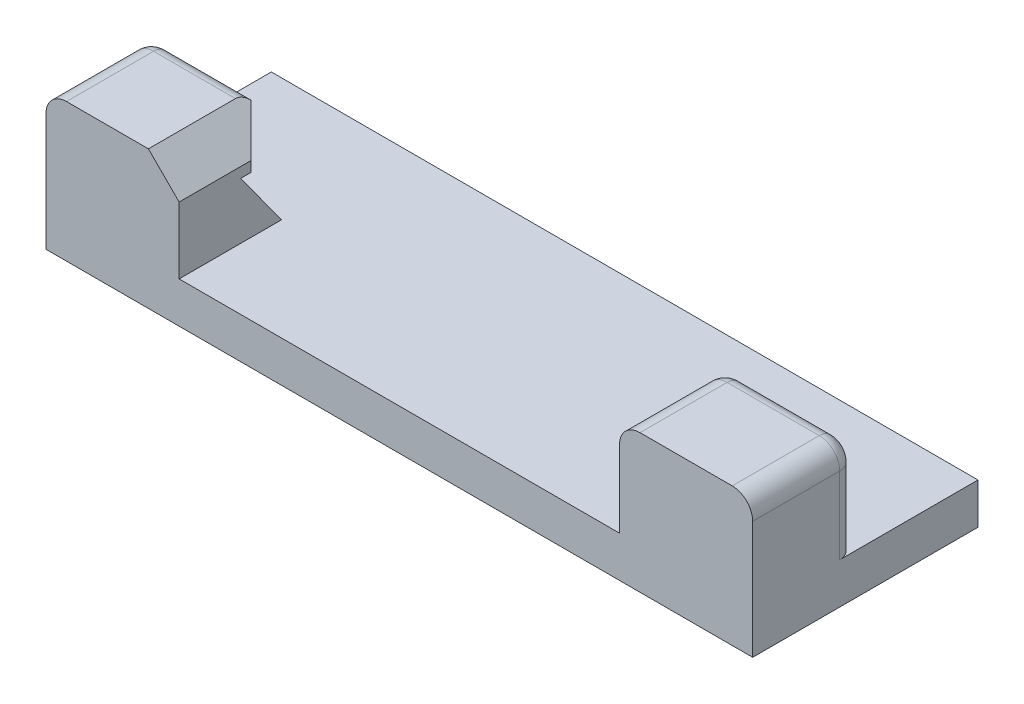
ISO-10303-21;
HEADER;
FILE_DESCRIPTION(('STEP AP214'),'2;1');
FILE_NAME('part.step','',(''),(''),'','','');
FILE_SCHEMA(('AUTOMOTIVE_DESIGN { 1 0 10303 214 1 1 1 1 }'));
ENDSEC;
DATA;
#1=APPLICATION_CONTEXT('core data for automotive mechanical design processes');
#2=APPLICATION_PROTOCOL_DEFINITION('international standard','automotive_design',2000,#1);
#3=PRODUCT_CONTEXT('',#1,'mechanical');
#4=PRODUCT('Part','Part','',(#3));
#5=PRODUCT_RELATED_PRODUCT_CATEGORY('part','',(#4));
#6=PRODUCT_DEFINITION_FORMATION('','',#4);
#7=PRODUCT_DEFINITION_CONTEXT('part definition',#1,'design');
#8=PRODUCT_DEFINITION('design','',#6,#7);
#9=PRODUCT_DEFINITION_SHAPE('','',#8);
#10=(LENGTH_UNIT() NAMED_UNIT(*) SI_UNIT(.MILLI.,.METRE.));
#11=(NAMED_UNIT(*) PLANE_ANGLE_UNIT() SI_UNIT($,.RADIAN.));
#12=(NAMED_UNIT(*) SI_UNIT($,.STERADIAN.) SOLID_ANGLE_UNIT());
#13=UNCERTAINTY_MEASURE_WITH_UNIT(LENGTH_MEASURE(1.E-05),#10,'distance_accuracy_value','');
#14=(GEOMETRIC_REPRESENTATION_CONTEXT(3) GLOBAL_UNCERTAINTY_ASSIGNED_CONTEXT((#13)) GLOBAL_UNIT_ASSIGNED_CONTEXT((#10,
#11,#12)) REPRESENTATION_CONTEXT('',''));
#15=CARTESIAN_POINT('',(0.,0.,0.));
#16=DIRECTION('',(0.,0.,1.));
#17=DIRECTION('',(1.,0.,0.));
#18=AXIS2_PLACEMENT_3D('',#15,#16,#17);
#19=CARTESIAN_POINT('',(-34.5,12.5,1.00000000000001));
#20=DIRECTION('',(0.,0.,1.));
#21=DIRECTION('',(1.,0.,0.));
#22=AXIS2_PLACEMENT_3D('',#19,#20,#21);
#23=PLANE('',#22);
#24=CARTESIAN_POINT('',(-32.5,10.5,1.00000000000001));
#25=DIRECTION('',(0.,0.,1.));
#26=DIRECTION('',(1.,0.,0.));
#27=AXIS2_PLACEMENT_3D('',#24,#25,#26);
#28=CIRCLE('',#27,0.5);
#29=CARTESIAN_POINT('',(-32.5,11.,1.00000000000001));
#30=VERTEX_POINT('',#29);
#31=CARTESIAN_POINT('',(-33.,10.5,1.00000000000001));
#32=VERTEX_POINT('',#31);
#33=EDGE_CURVE('E352',#30,#32,#28,.T.);
#34=ORIENTED_EDGE('',*,*,#33,.F.);
#35=DIRECTION('',(-1.,0.,0.));
#36=VECTOR('',#35,1.);
#37=CARTESIAN_POINT('',(-34.5,11.,1.00000000000001));
#38=LINE('',#37,#36);
#39=CARTESIAN_POINT('',(-24.5,11.,1.00000000000001));
#40=VERTEX_POINT('',#39);
#41=EDGE_CURVE('E339',#30,#40,#38,.F.);
#42=ORIENTED_EDGE('',*,*,#41,.T.);
#43=DIRECTION('',(0.,-1.,0.));
#44=VECTOR('',#43,1.);
#45=CARTESIAN_POINT('',(-24.5,12.5,1.00000000000001));
#46=LINE('',#45,#44);
#47=CARTESIAN_POINT('',(-24.5,8.5,0.999999999999996));
#48=VERTEX_POINT('',#47);
#49=EDGE_CURVE('E208',#40,#48,#46,.T.);
#50=ORIENTED_EDGE('',*,*,#49,.T.);
#51=DIRECTION('',(1.,0.,0.));
#52=VECTOR('',#51,1.);
#53=CARTESIAN_POINT('',(-31.5,8.5,0.999999999999996));
#54=LINE('',#53,#52);
#55=CARTESIAN_POINT('',(-31.5,8.5,0.999999999999996));
#56=VERTEX_POINT('',#55);
#57=EDGE_CURVE('E202',#56,#48,#54,.T.);
#58=ORIENTED_EDGE('',*,*,#57,.F.);
#59=DIRECTION('',(0.,1.,0.));
#60=VECTOR('',#59,1.);
#61=CARTESIAN_POINT('',(-31.5,3.,0.999999999999996));
#62=LINE('',#61,#60);
#63=CARTESIAN_POINT('',(-31.5,3.,1.00000000000001));
#64=VERTEX_POINT('',#63);
#65=EDGE_CURVE('E187',#64,#56,#62,.T.);
#66=ORIENTED_EDGE('',*,*,#65,.F.);
#67=DIRECTION('',(-1.,0.,0.));
#68=VECTOR('',#67,1.);
#69=CARTESIAN_POINT('',(-34.5,3.,1.00000000000001));
#70=LINE('',#69,#68);
#71=CARTESIAN_POINT('',(-33.,3.,1.00000000000001));
#72=VERTEX_POINT('',#71);
#73=EDGE_CURVE('E232',#64,#72,#70,.T.);
#74=ORIENTED_EDGE('',*,*,#73,.T.);
#75=DIRECTION('',(0.,-1.,0.));
#76=VECTOR('',#75,1.);
#77=CARTESIAN_POINT('',(-33.,12.5,1.00000000000001));
#78=LINE('',#77,#76);
#79=EDGE_CURVE('E341',#72,#32,#78,.F.);
#80=ORIENTED_EDGE('',*,*,#79,.T.);
#81=EDGE_LOOP('',(#34,#42,#50,#58,#66,#74,#80));
#82=FACE_BOUND('',#81,.T.);
#83=ADVANCED_FACE('F35',(#82),#23,.F.);
#84=CARTESIAN_POINT('',(0.,3.,0.));
#85=DIRECTION('',(0.,-1.,0.));
#86=DIRECTION('',(0.,0.,-1.));
#87=AXIS2_PLACEMENT_3D('',#84,#85,#86);
#88=PLANE('',#87);
#89=DIRECTION('',(-1.,0.,0.));
#90=VECTOR('',#89,1.);
#91=CARTESIAN_POINT('',(34.5,3.,0.999999999999996));
#92=LINE('',#91,#90);
#93=CARTESIAN_POINT('',(33.,3.,0.999999999999996));
#94=VERTEX_POINT('',#93);
#95=CARTESIAN_POINT('',(23.,3.,0.999999999999997));
#96=VERTEX_POINT('',#95);
#97=EDGE_CURVE('E211',#94,#96,#92,.T.);
#98=ORIENTED_EDGE('',*,*,#97,.F.);
#99=CARTESIAN_POINT('',(33.,3.,2.5));
#100=DIRECTION('',(0.,-1.,0.));
#101=DIRECTION('',(0.,0.,-1.));
#102=AXIS2_PLACEMENT_3D('',#99,#100,#101);
#103=CIRCLE('',#102,1.5);
#104=CARTESIAN_POINT('',(34.5,3.,2.5));
#105=VERTEX_POINT('',#104);
#106=EDGE_CURVE('E303',#94,#105,#103,.T.);
#107=ORIENTED_EDGE('',*,*,#106,.T.);
#108=DIRECTION('',(0.,0.,-1.));
#109=VECTOR('',#108,1.);
#110=CARTESIAN_POINT('',(34.5,3.,-11.));
#111=LINE('',#110,#109);
#112=CARTESIAN_POINT('',(34.5,3.,-11.));
#113=VERTEX_POINT('',#112);
#114=EDGE_CURVE('E241',#105,#113,#111,.T.);
#115=ORIENTED_EDGE('',*,*,#114,.T.);
#116=DIRECTION('',(-1.,0.,0.));
#117=VECTOR('',#116,1.);
#118=CARTESIAN_POINT('',(34.5,3.,-11.));
#119=LINE('',#118,#117);
#120=CARTESIAN_POINT('',(-34.5,3.,-11.));
#121=VERTEX_POINT('',#120);
#122=EDGE_CURVE('E243',#113,#121,#119,.T.);
#123=ORIENTED_EDGE('',*,*,#122,.T.);
#124=DIRECTION('',(0.,0.,1.));
#125=VECTOR('',#124,1.);
#126=CARTESIAN_POINT('',(-34.5,3.,-11.));
#127=LINE('',#126,#125);
#128=CARTESIAN_POINT('',(-34.5,3.,2.50000000000001));
#129=VERTEX_POINT('',#128);
#130=EDGE_CURVE('E235',#121,#129,#127,.T.);
#131=ORIENTED_EDGE('',*,*,#130,.T.);
#132=CARTESIAN_POINT('',(-33.,3.,2.50000000000001));
#133=DIRECTION('',(0.,-1.,0.));
#134=DIRECTION('',(0.,0.,-1.));
#135=AXIS2_PLACEMENT_3D('',#132,#133,#134);
#136=CIRCLE('',#135,1.5);
#137=EDGE_CURVE('E350',#129,#72,#136,.T.);
#138=ORIENTED_EDGE('',*,*,#137,.T.);
#139=ORIENTED_EDGE('',*,*,#73,.F.);
#140=CARTESIAN_POINT('',(-21.5,3.,0.999999999999996));
#141=VERTEX_POINT('',#140);
#142=EDGE_CURVE('E229',#141,#64,#70,.T.);
#143=ORIENTED_EDGE('',*,*,#142,.F.);
#144=DIRECTION('',(0.,0.,-1.));
#145=VECTOR('',#144,1.);
#146=CARTESIAN_POINT('',(-21.5,3.,11.));
#147=LINE('',#146,#145);
#148=CARTESIAN_POINT('',(-21.5,3.,11.));
#149=VERTEX_POINT('',#148);
#150=EDGE_CURVE('E225',#149,#141,#147,.T.);
#151=ORIENTED_EDGE('',*,*,#150,.F.);
#152=DIRECTION('',(1.,0.,0.));
#153=VECTOR('',#152,1.);
#154=CARTESIAN_POINT('',(34.5,3.,11.));
#155=LINE('',#154,#153);
#156=CARTESIAN_POINT('',(21.5,3.,11.));
#157=VERTEX_POINT('',#156);
#158=EDGE_CURVE('E238',#149,#157,#155,.T.);
#159=ORIENTED_EDGE('',*,*,#158,.T.);
#160=DIRECTION('',(0.,0.,1.));
#161=VECTOR('',#160,1.);
#162=CARTESIAN_POINT('',(21.5,3.,11.));
#163=LINE('',#162,#161);
#164=CARTESIAN_POINT('',(21.5,3.,2.5));
#165=VERTEX_POINT('',#164);
#166=EDGE_CURVE('E219',#165,#157,#163,.T.);
#167=ORIENTED_EDGE('',*,*,#166,.F.);
#168=CARTESIAN_POINT('',(23.,3.,2.5));
#169=DIRECTION('',(0.,-1.,0.));
#170=DIRECTION('',(0.,0.,-1.));
#171=AXIS2_PLACEMENT_3D('',#168,#169,#170);
#172=CIRCLE('',#171,1.5);
#173=EDGE_CURVE('E306',#165,#96,#172,.T.);
#174=ORIENTED_EDGE('',*,*,#173,.T.);
#175=EDGE_LOOP('',(#98,#107,#115,#123,#131,#138,#139,#143,#151,#159,#167,#174));
#176=FACE_BOUND('',#175,.T.);
#177=ADVANCED_FACE('F383',(#176),#88,.F.);
#178=CARTESIAN_POINT('',(-34.5,-1.,-11.));
#179=DIRECTION('',(-1.,0.,0.));
#180=DIRECTION('',(0.,0.,1.));
#181=AXIS2_PLACEMENT_3D('',#178,#179,#180);
#182=PLANE('',#181);
#183=DIRECTION('',(0.,1.,0.));
#184=VECTOR('',#183,1.);
#185=CARTESIAN_POINT('',(-34.5,-1.,11.));
#186=LINE('',#185,#184);
#187=CARTESIAN_POINT('',(-34.5,-1.,11.));
#188=VERTEX_POINT('',#187);
#189=CARTESIAN_POINT('',(-34.5,10.5,11.));
#190=VERTEX_POINT('',#189);
#191=EDGE_CURVE('E258',#188,#190,#186,.T.);
#192=ORIENTED_EDGE('',*,*,#191,.T.);
#193=DIRECTION('',(0.,0.,1.));
#194=VECTOR('',#193,1.);
#195=CARTESIAN_POINT('',(-34.5,10.5,2.50000000000001));
#196=LINE('',#195,#194);
#197=CARTESIAN_POINT('',(-34.5,10.5,2.50000000000001));
#198=VERTEX_POINT('',#197);
#199=EDGE_CURVE('E11',#190,#198,#196,.F.);
#200=ORIENTED_EDGE('',*,*,#199,.T.);
#201=DIRECTION('',(0.,-1.,0.));
#202=VECTOR('',#201,1.);
#203=CARTESIAN_POINT('',(-34.5,3.,2.50000000000001));
#204=LINE('',#203,#202);
#205=EDGE_CURVE('E336',#198,#129,#204,.T.);
#206=ORIENTED_EDGE('',*,*,#205,.T.);
#207=ORIENTED_EDGE('',*,*,#130,.F.);
#208=DIRECTION('',(0.,1.,0.));
#209=VECTOR('',#208,1.);
#210=CARTESIAN_POINT('',(-34.5,-1.,-11.));
#211=LINE('',#210,#209);
#212=CARTESIAN_POINT('',(-34.5,-1.,-11.));
#213=VERTEX_POINT('',#212);
#214=EDGE_CURVE('E259',#213,#121,#211,.T.);
#215=ORIENTED_EDGE('',*,*,#214,.F.);
#216=DIRECTION('',(0.,0.,1.));
#217=VECTOR('',#216,1.);
#218=CARTESIAN_POINT('',(-34.5,-1.,-11.));
#219=LINE('',#218,#217);
#220=EDGE_CURVE('E246',#213,#188,#219,.T.);
#221=ORIENTED_EDGE('',*,*,#220,.T.);
#222=EDGE_LOOP('',(#192,#200,#206,#207,#215,#221));
#223=FACE_BOUND('',#222,.T.);
#224=ADVANCED_FACE('F388',(#223),#182,.T.);
#225=CARTESIAN_POINT('',(34.5,-1.,-11.));
#226=DIRECTION('',(0.,0.,-1.));
#227=DIRECTION('',(-1.,0.,0.));
#228=AXIS2_PLACEMENT_3D('',#225,#226,#227);
#229=PLANE('',#228);
#230=ORIENTED_EDGE('',*,*,#214,.T.);
#231=ORIENTED_EDGE('',*,*,#122,.F.);
#232=DIRECTION('',(0.,1.,0.));
#233=VECTOR('',#232,1.);
#234=CARTESIAN_POINT('',(34.5,-1.,-11.));
#235=LINE('',#234,#233);
#236=CARTESIAN_POINT('',(34.5,-1.,-11.));
#237=VERTEX_POINT('',#236);
#238=EDGE_CURVE('E262',#237,#113,#235,.T.);
#239=ORIENTED_EDGE('',*,*,#238,.F.);
#240=DIRECTION('',(-1.,0.,0.));
#241=VECTOR('',#240,1.);
#242=CARTESIAN_POINT('',(34.5,-1.,-11.));
#243=LINE('',#242,#241);
#244=EDGE_CURVE('E255',#237,#213,#243,.T.);
#245=ORIENTED_EDGE('',*,*,#244,.T.);
#246=EDGE_LOOP('',(#230,#231,#239,#245));
#247=FACE_BOUND('',#246,.T.);
#248=ADVANCED_FACE('F479',(#247),#229,.T.);
#249=CARTESIAN_POINT('',(34.5,-1.,-11.));
#250=DIRECTION('',(1.,0.,0.));
#251=DIRECTION('',(0.,0.,-1.));
#252=AXIS2_PLACEMENT_3D('',#249,#250,#251);
#253=PLANE('',#252);
#254=ORIENTED_EDGE('',*,*,#114,.F.);
#255=DIRECTION('',(0.,-1.,0.));
#256=VECTOR('',#255,1.);
#257=CARTESIAN_POINT('',(34.5,10.5,2.5));
#258=LINE('',#257,#256);
#259=CARTESIAN_POINT('',(34.5,10.5,2.5));
#260=VERTEX_POINT('',#259);
#261=EDGE_CURVE('E293',#105,#260,#258,.F.);
#262=ORIENTED_EDGE('',*,*,#261,.T.);
#263=DIRECTION('',(0.,0.,-1.));
#264=VECTOR('',#263,1.);
#265=CARTESIAN_POINT('',(34.5,10.5,-11.));
#266=LINE('',#265,#264);
#267=CARTESIAN_POINT('',(34.5,10.5,11.));
#268=VERTEX_POINT('',#267);
#269=EDGE_CURVE('E280',#260,#268,#266,.F.);
#270=ORIENTED_EDGE('',*,*,#269,.T.);
#271=DIRECTION('',(0.,1.,0.));
#272=VECTOR('',#271,1.);
#273=CARTESIAN_POINT('',(34.5,-1.,11.));
#274=LINE('',#273,#272);
#275=CARTESIAN_POINT('',(34.5,-1.,11.));
#276=VERTEX_POINT('',#275);
#277=EDGE_CURVE('E265',#276,#268,#274,.T.);
#278=ORIENTED_EDGE('',*,*,#277,.F.);
#279=DIRECTION('',(0.,0.,-1.));
#280=VECTOR('',#279,1.);
#281=CARTESIAN_POINT('',(34.5,-1.,-11.));
#282=LINE('',#281,#280);
#283=EDGE_CURVE('E252',#276,#237,#282,.T.);
#284=ORIENTED_EDGE('',*,*,#283,.T.);
#285=ORIENTED_EDGE('',*,*,#238,.T.);
#286=EDGE_LOOP('',(#254,#262,#270,#278,#284,#285));
#287=FACE_BOUND('',#286,.T.);
#288=ADVANCED_FACE('F397',(#287),#253,.T.);
#289=CARTESIAN_POINT('',(34.5,-1.,11.));
#290=DIRECTION('',(0.,0.,1.));
#291=DIRECTION('',(1.,0.,0.));
#292=AXIS2_PLACEMENT_3D('',#289,#290,#291);
#293=PLANE('',#292);
#294=DIRECTION('',(1.,0.,0.));
#295=VECTOR('',#294,1.);
#296=CARTESIAN_POINT('',(-34.5,12.5,11.));
#297=LINE('',#296,#295);
#298=CARTESIAN_POINT('',(-32.5,12.5,11.));
#299=VERTEX_POINT('',#298);
#300=CARTESIAN_POINT('',(-24.5,12.5,11.));
#301=VERTEX_POINT('',#300);
#302=EDGE_CURVE('E226',#299,#301,#297,.T.);
#303=ORIENTED_EDGE('',*,*,#302,.F.);
#304=CARTESIAN_POINT('',(-32.5,10.5,11.));
#305=DIRECTION('',(0.,0.,1.));
#306=DIRECTION('',(1.,0.,0.));
#307=AXIS2_PLACEMENT_3D('',#304,#305,#306);
#308=CIRCLE('',#307,2.);
#309=EDGE_CURVE('E44',#299,#190,#308,.T.);
#310=ORIENTED_EDGE('',*,*,#309,.T.);
#311=ORIENTED_EDGE('',*,*,#191,.F.);
#312=DIRECTION('',(1.,0.,0.));
#313=VECTOR('',#312,1.);
#314=CARTESIAN_POINT('',(34.5,-1.,11.));
#315=LINE('',#314,#313);
#316=EDGE_CURVE('E249',#188,#276,#315,.T.);
#317=ORIENTED_EDGE('',*,*,#316,.T.);
#318=ORIENTED_EDGE('',*,*,#277,.T.);
#319=CARTESIAN_POINT('',(32.5,10.5,11.));
#320=DIRECTION('',(0.,0.,1.));
#321=DIRECTION('',(1.,0.,0.));
#322=AXIS2_PLACEMENT_3D('',#319,#320,#321);
#323=CIRCLE('',#322,2.);
#324=CARTESIAN_POINT('',(32.5,12.5,11.));
#325=VERTEX_POINT('',#324);
#326=EDGE_CURVE('E273',#268,#325,#323,.T.);
#327=ORIENTED_EDGE('',*,*,#326,.T.);
#328=DIRECTION('',(1.,0.,0.));
#329=VECTOR('',#328,1.);
#330=CARTESIAN_POINT('',(34.5,12.5,11.));
#331=LINE('',#330,#329);
#332=CARTESIAN_POINT('',(23.5,12.5,11.));
#333=VERTEX_POINT('',#332);
#334=EDGE_CURVE('E215',#333,#325,#331,.T.);
#335=ORIENTED_EDGE('',*,*,#334,.F.);
#336=CARTESIAN_POINT('',(23.5,10.5,11.));
#337=DIRECTION('',(0.,0.,1.));
#338=DIRECTION('',(1.,0.,0.));
#339=AXIS2_PLACEMENT_3D('',#336,#337,#338);
#340=CIRCLE('',#339,2.);
#341=CARTESIAN_POINT('',(21.5,10.5,11.));
#342=VERTEX_POINT('',#341);
#343=EDGE_CURVE('E275',#333,#342,#340,.T.);
#344=ORIENTED_EDGE('',*,*,#343,.T.);
#345=DIRECTION('',(0.,-1.,0.));
#346=VECTOR('',#345,1.);
#347=CARTESIAN_POINT('',(21.5,12.5,11.));
#348=LINE('',#347,#346);
#349=EDGE_CURVE('E218',#342,#157,#348,.T.);
#350=ORIENTED_EDGE('',*,*,#349,.T.);
#351=ORIENTED_EDGE('',*,*,#158,.F.);
#352=DIRECTION('',(0.,-1.,0.));
#353=VECTOR('',#352,1.);
#354=CARTESIAN_POINT('',(-21.5,12.5,11.));
#355=LINE('',#354,#353);
#356=CARTESIAN_POINT('',(-21.5,9.49999999999998,11.));
#357=VERTEX_POINT('',#356);
#358=EDGE_CURVE('E228',#357,#149,#355,.T.);
#359=ORIENTED_EDGE('',*,*,#358,.F.);
#360=DIRECTION('',(0.707106781186547,-0.707106781186548,0.));
#361=VECTOR('',#360,1.);
#362=CARTESIAN_POINT('',(11.7499999999999,-23.75,11.));
#363=LINE('',#362,#361);
#364=EDGE_CURVE('E333',#357,#301,#363,.F.);
#365=ORIENTED_EDGE('',*,*,#364,.T.);
#366=EDGE_LOOP('',(#303,#310,#311,#317,#318,#327,#335,#344,#350,#351,#359,#365));
#367=FACE_BOUND('',#366,.T.);
#368=ADVANCED_FACE('F391',(#367),#293,.T.);
#369=CARTESIAN_POINT('',(0.,-1.,0.));
#370=DIRECTION('',(0.,-1.,0.));
#371=DIRECTION('',(0.,0.,-1.));
#372=AXIS2_PLACEMENT_3D('',#369,#370,#371);
#373=PLANE('',#372);
#374=ORIENTED_EDGE('',*,*,#220,.F.);
#375=ORIENTED_EDGE('',*,*,#244,.F.);
#376=ORIENTED_EDGE('',*,*,#283,.F.);
#377=ORIENTED_EDGE('',*,*,#316,.F.);
#378=EDGE_LOOP('',(#374,#375,#376,#377));
#379=FACE_BOUND('',#378,.T.);
#380=ADVANCED_FACE('F394',(#379),#373,.T.);
#381=CARTESIAN_POINT('',(-21.5,12.5,11.));
#382=DIRECTION('',(-1.,0.,0.));
#383=DIRECTION('',(0.,0.,1.));
#384=AXIS2_PLACEMENT_3D('',#381,#382,#383);
#385=PLANE('',#384);
#386=DIRECTION('',(0.,0.,1.));
#387=VECTOR('',#386,1.);
#388=CARTESIAN_POINT('',(-21.5,8.5,0.999999999999996));
#389=LINE('',#388,#387);
#390=CARTESIAN_POINT('',(-21.5,8.5,4.00000000000002));
#391=VERTEX_POINT('',#390);
#392=CARTESIAN_POINT('',(-21.5,8.5,5.));
#393=VERTEX_POINT('',#392);
#394=EDGE_CURVE('E451',#391,#393,#389,.T.);
#395=ORIENTED_EDGE('',*,*,#394,.F.);
#396=DIRECTION('',(0.,1.,0.));
#397=VECTOR('',#396,1.);
#398=CARTESIAN_POINT('',(-21.5,12.5,4.00000000000002));
#399=LINE('',#398,#397);
#400=CARTESIAN_POINT('',(-21.5,9.49999999999998,4.00000000000002));
#401=VERTEX_POINT('',#400);
#402=EDGE_CURVE('E327',#391,#401,#399,.T.);
#403=ORIENTED_EDGE('',*,*,#402,.T.);
#404=DIRECTION('',(0.,0.,1.));
#405=VECTOR('',#404,1.);
#406=CARTESIAN_POINT('',(-21.5,9.49999999999998,11.));
#407=LINE('',#406,#405);
#408=EDGE_CURVE('E325',#401,#357,#407,.T.);
#409=ORIENTED_EDGE('',*,*,#408,.T.);
#410=ORIENTED_EDGE('',*,*,#358,.T.);
#411=ORIENTED_EDGE('',*,*,#150,.T.);
#412=DIRECTION('',(0.,-0.808736084303189,-0.588171697675046));
#413=VECTOR('',#412,1.);
#414=CARTESIAN_POINT('',(-21.5,3.,0.999999999999996));
#415=LINE('',#414,#413);
#416=EDGE_CURVE('E321',#393,#141,#415,.T.);
#417=ORIENTED_EDGE('',*,*,#416,.F.);
#418=EDGE_LOOP('',(#395,#403,#409,#410,#411,#417));
#419=FACE_BOUND('',#418,.T.);
#420=ADVANCED_FACE('F453',(#419),#385,.F.);
#421=CARTESIAN_POINT('',(0.,12.5,0.));
#422=DIRECTION('',(0.,-1.,0.));
#423=DIRECTION('',(0.,0.,-1.));
#424=AXIS2_PLACEMENT_3D('',#421,#422,#423);
#425=PLANE('',#424);
#426=DIRECTION('',(-1.,0.,0.));
#427=VECTOR('',#426,1.);
#428=CARTESIAN_POINT('',(0.,12.5,2.50000000000001));
#429=LINE('',#428,#427);
#430=CARTESIAN_POINT('',(-24.5,12.5,2.50000000000001));
#431=VERTEX_POINT('',#430);
#432=CARTESIAN_POINT('',(-32.5,12.5,2.50000000000001));
#433=VERTEX_POINT('',#432);
#434=EDGE_CURVE('E344',#431,#433,#429,.T.);
#435=ORIENTED_EDGE('',*,*,#434,.T.);
#436=DIRECTION('',(0.,0.,1.));
#437=VECTOR('',#436,1.);
#438=CARTESIAN_POINT('',(-32.5,12.5,11.));
#439=LINE('',#438,#437);
#440=EDGE_CURVE('E58',#433,#299,#439,.T.);
#441=ORIENTED_EDGE('',*,*,#440,.T.);
#442=ORIENTED_EDGE('',*,*,#302,.T.);
#443=DIRECTION('',(0.,0.,-1.));
#444=VECTOR('',#443,1.);
#445=CARTESIAN_POINT('',(-24.5,12.5,0.));
#446=LINE('',#445,#444);
#447=EDGE_CURVE('E330',#301,#431,#446,.T.);
#448=ORIENTED_EDGE('',*,*,#447,.T.);
#449=EDGE_LOOP('',(#435,#441,#442,#448));
#450=FACE_BOUND('',#449,.T.);
#451=ADVANCED_FACE('F368',(#450),#425,.F.);
#452=CARTESIAN_POINT('',(34.5,12.5,0.999999999999996));
#453=DIRECTION('',(0.,0.,1.));
#454=DIRECTION('',(1.,0.,0.));
#455=AXIS2_PLACEMENT_3D('',#452,#453,#454);
#456=PLANE('',#455);
#457=CARTESIAN_POINT('',(32.5,10.5,0.999999999999996));
#458=DIRECTION('',(0.,0.,1.));
#459=DIRECTION('',(1.,0.,0.));
#460=AXIS2_PLACEMENT_3D('',#457,#458,#459);
#461=CIRCLE('',#460,0.5);
#462=CARTESIAN_POINT('',(32.5,11.,0.999999999999996));
#463=VERTEX_POINT('',#462);
#464=CARTESIAN_POINT('',(33.,10.5,0.999999999999996));
#465=VERTEX_POINT('',#464);
#466=EDGE_CURVE('E288',#463,#465,#461,.F.);
#467=ORIENTED_EDGE('',*,*,#466,.T.);
#468=DIRECTION('',(0.,-1.,0.));
#469=VECTOR('',#468,1.);
#470=CARTESIAN_POINT('',(33.,3.,0.999999999999996));
#471=LINE('',#470,#469);
#472=EDGE_CURVE('E290',#465,#94,#471,.T.);
#473=ORIENTED_EDGE('',*,*,#472,.T.);
#474=ORIENTED_EDGE('',*,*,#97,.T.);
#475=DIRECTION('',(0.,-1.,0.));
#476=VECTOR('',#475,1.);
#477=CARTESIAN_POINT('',(23.,12.5,0.999999999999997));
#478=LINE('',#477,#476);
#479=CARTESIAN_POINT('',(23.,10.5,0.999999999999997));
#480=VERTEX_POINT('',#479);
#481=EDGE_CURVE('E286',#96,#480,#478,.F.);
#482=ORIENTED_EDGE('',*,*,#481,.T.);
#483=CARTESIAN_POINT('',(23.5,10.5,0.999999999999997));
#484=DIRECTION('',(0.,0.,1.));
#485=DIRECTION('',(1.,0.,0.));
#486=AXIS2_PLACEMENT_3D('',#483,#484,#485);
#487=CIRCLE('',#486,0.5);
#488=CARTESIAN_POINT('',(23.5,11.,0.999999999999997));
#489=VERTEX_POINT('',#488);
#490=EDGE_CURVE('E284',#480,#489,#487,.F.);
#491=ORIENTED_EDGE('',*,*,#490,.T.);
#492=DIRECTION('',(-1.,0.,0.));
#493=VECTOR('',#492,1.);
#494=CARTESIAN_POINT('',(32.5,11.,0.999999999999996));
#495=LINE('',#494,#493);
#496=EDGE_CURVE('E282',#489,#463,#495,.F.);
#497=ORIENTED_EDGE('',*,*,#496,.T.);
#498=EDGE_LOOP('',(#467,#473,#474,#482,#491,#497));
#499=FACE_BOUND('',#498,.T.);
#500=ADVANCED_FACE('F420',(#499),#456,.F.);
#501=CARTESIAN_POINT('',(21.5,12.5,11.));
#502=DIRECTION('',(1.,0.,0.));
#503=DIRECTION('',(0.,0.,-1.));
#504=AXIS2_PLACEMENT_3D('',#501,#502,#503);
#505=PLANE('',#504);
#506=DIRECTION('',(0.,0.,1.));
#507=VECTOR('',#506,1.);
#508=CARTESIAN_POINT('',(21.5,10.5,0.999999999999997));
#509=LINE('',#508,#507);
#510=CARTESIAN_POINT('',(21.5,10.5,2.5));
#511=VERTEX_POINT('',#510);
#512=EDGE_CURVE('E277',#342,#511,#509,.F.);
#513=ORIENTED_EDGE('',*,*,#512,.T.);
#514=DIRECTION('',(0.,-1.,0.));
#515=VECTOR('',#514,1.);
#516=CARTESIAN_POINT('',(21.5,12.5,2.5));
#517=LINE('',#516,#515);
#518=EDGE_CURVE('E297',#511,#165,#517,.T.);
#519=ORIENTED_EDGE('',*,*,#518,.T.);
#520=ORIENTED_EDGE('',*,*,#166,.T.);
#521=ORIENTED_EDGE('',*,*,#349,.F.);
#522=EDGE_LOOP('',(#513,#519,#520,#521));
#523=FACE_BOUND('',#522,.T.);
#524=ADVANCED_FACE('F434',(#523),#505,.F.);
#525=CARTESIAN_POINT('',(0.,12.5,0.));
#526=DIRECTION('',(0.,1.,0.));
#527=DIRECTION('',(0.,0.,1.));
#528=AXIS2_PLACEMENT_3D('',#525,#526,#527);
#529=PLANE('',#528);
#530=DIRECTION('',(0.,0.,-1.));
#531=VECTOR('',#530,1.);
#532=CARTESIAN_POINT('',(32.5,12.5,0.));
#533=LINE('',#532,#531);
#534=CARTESIAN_POINT('',(32.5,12.5,2.5));
#535=VERTEX_POINT('',#534);
#536=EDGE_CURVE('E261',#325,#535,#533,.T.);
#537=ORIENTED_EDGE('',*,*,#536,.T.);
#538=DIRECTION('',(-1.,0.,0.));
#539=VECTOR('',#538,1.);
#540=CARTESIAN_POINT('',(23.5,12.5,2.5));
#541=LINE('',#540,#539);
#542=CARTESIAN_POINT('',(23.5,12.5,2.5));
#543=VERTEX_POINT('',#542);
#544=EDGE_CURVE('E301',#535,#543,#541,.T.);
#545=ORIENTED_EDGE('',*,*,#544,.T.);
#546=DIRECTION('',(0.,0.,1.));
#547=VECTOR('',#546,1.);
#548=CARTESIAN_POINT('',(23.5,12.5,11.));
#549=LINE('',#548,#547);
#550=EDGE_CURVE('E271',#543,#333,#549,.T.);
#551=ORIENTED_EDGE('',*,*,#550,.T.);
#552=ORIENTED_EDGE('',*,*,#334,.T.);
#553=EDGE_LOOP('',(#537,#545,#551,#552));
#554=FACE_BOUND('',#553,.T.);
#555=ADVANCED_FACE('F407',(#554),#529,.T.);
#556=CARTESIAN_POINT('',(-31.5,3.,0.999999999999996));
#557=DIRECTION('',(0.,-0.588171697675046,0.808736084303189));
#558=DIRECTION('',(0.,-0.808736084303189,-0.588171697675046));
#559=AXIS2_PLACEMENT_3D('',#556,#557,#558);
#560=PLANE('',#559);
#561=ORIENTED_EDGE('',*,*,#416,.T.);
#562=ORIENTED_EDGE('',*,*,#142,.T.);
#563=DIRECTION('',(0.,-0.808736084303189,-0.588171697675046));
#564=VECTOR('',#563,1.);
#565=CARTESIAN_POINT('',(-31.5,3.,0.999999999999996));
#566=LINE('',#565,#564);
#567=CARTESIAN_POINT('',(-31.5,8.5,5.));
#568=VERTEX_POINT('',#567);
#569=EDGE_CURVE('E192',#568,#64,#566,.T.);
#570=ORIENTED_EDGE('',*,*,#569,.F.);
#571=DIRECTION('',(1.,0.,0.));
#572=VECTOR('',#571,1.);
#573=CARTESIAN_POINT('',(-31.5,8.5,5.));
#574=LINE('',#573,#572);
#575=EDGE_CURVE('E204',#568,#393,#574,.T.);
#576=ORIENTED_EDGE('',*,*,#575,.T.);
#577=EDGE_LOOP('',(#561,#562,#570,#576));
#578=FACE_BOUND('',#577,.T.);
#579=ADVANCED_FACE('F457',(#578),#560,.F.);
#580=CARTESIAN_POINT('',(-31.5,8.5,0.999999999999996));
#581=DIRECTION('',(0.,1.,0.));
#582=DIRECTION('',(0.,0.,1.));
#583=AXIS2_PLACEMENT_3D('',#580,#581,#582);
#584=PLANE('',#583);
#585=ORIENTED_EDGE('',*,*,#57,.T.);
#586=DIRECTION('',(-0.707106781186547,0.,-0.707106781186548));
#587=VECTOR('',#586,1.);
#588=CARTESIAN_POINT('',(-24.5,8.5,1.00000000000001));
#589=LINE('',#588,#587);
#590=EDGE_CURVE('E323',#48,#391,#589,.F.);
#591=ORIENTED_EDGE('',*,*,#590,.T.);
#592=ORIENTED_EDGE('',*,*,#394,.T.);
#593=ORIENTED_EDGE('',*,*,#575,.F.);
#594=DIRECTION('',(0.,0.,1.));
#595=VECTOR('',#594,1.);
#596=CARTESIAN_POINT('',(-31.5,8.5,0.999999999999996));
#597=LINE('',#596,#595);
#598=EDGE_CURVE('E190',#56,#568,#597,.T.);
#599=ORIENTED_EDGE('',*,*,#598,.F.);
#600=EDGE_LOOP('',(#585,#591,#592,#593,#599));
#601=FACE_BOUND('',#600,.T.);
#602=ADVANCED_FACE('F201',(#601),#584,.F.);
#603=CARTESIAN_POINT('',(-31.5,0.,0.));
#604=DIRECTION('',(1.,0.,0.));
#605=DIRECTION('',(0.,0.,-1.));
#606=AXIS2_PLACEMENT_3D('',#603,#604,#605);
#607=PLANE('',#606);
#608=ORIENTED_EDGE('',*,*,#569,.T.);
#609=ORIENTED_EDGE('',*,*,#65,.T.);
#610=ORIENTED_EDGE('',*,*,#598,.T.);
#611=EDGE_LOOP('',(#608,#609,#610));
#612=FACE_BOUND('',#611,.T.);
#613=ADVANCED_FACE('F189',(#612),#607,.T.);
#614=CARTESIAN_POINT('',(23.5,10.5,0.));
#615=DIRECTION('',(0.,0.,-1.));
#616=DIRECTION('',(-1.,0.,0.));
#617=AXIS2_PLACEMENT_3D('',#614,#615,#616);
#618=CYLINDRICAL_SURFACE('',#617,2.);
#619=ORIENTED_EDGE('',*,*,#550,.F.);
#620=CARTESIAN_POINT('',(23.5,10.5,2.5));
#621=DIRECTION('',(0.,0.,1.));
#622=DIRECTION('',(1.,0.,0.));
#623=AXIS2_PLACEMENT_3D('',#620,#621,#622);
#624=CIRCLE('',#623,2.);
#625=EDGE_CURVE('E299',#543,#511,#624,.T.);
#626=ORIENTED_EDGE('',*,*,#625,.T.);
#627=ORIENTED_EDGE('',*,*,#512,.F.);
#628=ORIENTED_EDGE('',*,*,#343,.F.);
#629=EDGE_LOOP('',(#619,#626,#627,#628));
#630=FACE_BOUND('',#629,.T.);
#631=ADVANCED_FACE('F429',(#630),#618,.T.);
#632=CARTESIAN_POINT('',(32.5,10.5,0.));
#633=DIRECTION('',(0.,0.,-1.));
#634=DIRECTION('',(-1.,0.,0.));
#635=AXIS2_PLACEMENT_3D('',#632,#633,#634);
#636=CYLINDRICAL_SURFACE('',#635,2.);
#637=ORIENTED_EDGE('',*,*,#269,.F.);
#638=CARTESIAN_POINT('',(32.5,10.5,2.5));
#639=DIRECTION('',(0.,0.,1.));
#640=DIRECTION('',(1.,0.,0.));
#641=AXIS2_PLACEMENT_3D('',#638,#639,#640);
#642=CIRCLE('',#641,2.);
#643=EDGE_CURVE('E295',#260,#535,#642,.T.);
#644=ORIENTED_EDGE('',*,*,#643,.T.);
#645=ORIENTED_EDGE('',*,*,#536,.F.);
#646=ORIENTED_EDGE('',*,*,#326,.F.);
#647=EDGE_LOOP('',(#637,#644,#645,#646));
#648=FACE_BOUND('',#647,.T.);
#649=ADVANCED_FACE('F403',(#648),#636,.T.);
#650=CARTESIAN_POINT('',(23.,12.5,2.5));
#651=DIRECTION('',(0.,-1.,0.));
#652=DIRECTION('',(0.,0.,-1.));
#653=AXIS2_PLACEMENT_3D('',#650,#651,#652);
#654=CYLINDRICAL_SURFACE('',#653,1.5);
#655=ORIENTED_EDGE('',*,*,#173,.F.);
#656=ORIENTED_EDGE('',*,*,#518,.F.);
#657=CARTESIAN_POINT('',(23.,10.5,2.5));
#658=DIRECTION('',(0.,1.,0.));
#659=DIRECTION('',(0.,0.,1.));
#660=AXIS2_PLACEMENT_3D('',#657,#658,#659);
#661=CIRCLE('',#660,1.5);
#662=EDGE_CURVE('E318',#480,#511,#661,.T.);
#663=ORIENTED_EDGE('',*,*,#662,.F.);
#664=ORIENTED_EDGE('',*,*,#481,.F.);
#665=EDGE_LOOP('',(#655,#656,#663,#664));
#666=FACE_BOUND('',#665,.T.);
#667=ADVANCED_FACE('F438',(#666),#654,.T.);
#668=CARTESIAN_POINT('',(23.5,10.5,2.5));
#669=DIRECTION('',(0.,0.,1.));
#670=DIRECTION('',(1.,0.,0.));
#671=AXIS2_PLACEMENT_3D('',#668,#669,#670);
#672=DEGENERATE_TOROIDAL_SURFACE('',#671,0.5,1.5,.T.);
#673=ORIENTED_EDGE('',*,*,#662,.T.);
#674=ORIENTED_EDGE('',*,*,#625,.F.);
#675=CARTESIAN_POINT('',(23.5,11.,2.5));
#676=DIRECTION('',(1.,0.,0.));
#677=DIRECTION('',(0.,0.,-1.));
#678=AXIS2_PLACEMENT_3D('',#675,#676,#677);
#679=CIRCLE('',#678,1.5);
#680=EDGE_CURVE('E315',#489,#543,#679,.T.);
#681=ORIENTED_EDGE('',*,*,#680,.F.);
#682=ORIENTED_EDGE('',*,*,#490,.F.);
#683=EDGE_LOOP('',(#673,#674,#681,#682));
#684=FACE_BOUND('',#683,.T.);
#685=ADVANCED_FACE('F426',(#684),#672,.T.);
#686=CARTESIAN_POINT('',(0.,11.,2.5));
#687=DIRECTION('',(1.,0.,0.));
#688=DIRECTION('',(0.,0.,-1.));
#689=AXIS2_PLACEMENT_3D('',#686,#687,#688);
#690=CYLINDRICAL_SURFACE('',#689,1.5);
#691=ORIENTED_EDGE('',*,*,#680,.T.);
#692=ORIENTED_EDGE('',*,*,#544,.F.);
#693=CARTESIAN_POINT('',(32.5,11.,2.5));
#694=DIRECTION('',(1.,0.,0.));
#695=DIRECTION('',(0.,0.,-1.));
#696=AXIS2_PLACEMENT_3D('',#693,#694,#695);
#697=CIRCLE('',#696,1.5);
#698=EDGE_CURVE('E311',#463,#535,#697,.T.);
#699=ORIENTED_EDGE('',*,*,#698,.F.);
#700=ORIENTED_EDGE('',*,*,#496,.F.);
#701=EDGE_LOOP('',(#691,#692,#699,#700));
#702=FACE_BOUND('',#701,.T.);
#703=ADVANCED_FACE('F411',(#702),#690,.T.);
#704=CARTESIAN_POINT('',(32.5,10.5,2.5));
#705=DIRECTION('',(0.,0.,1.));
#706=DIRECTION('',(1.,0.,0.));
#707=AXIS2_PLACEMENT_3D('',#704,#705,#706);
#708=DEGENERATE_TOROIDAL_SURFACE('',#707,0.5,1.5,.T.);
#709=ORIENTED_EDGE('',*,*,#698,.T.);
#710=ORIENTED_EDGE('',*,*,#643,.F.);
#711=CARTESIAN_POINT('',(33.,10.5,2.5));
#712=DIRECTION('',(0.,-1.,0.));
#713=DIRECTION('',(0.,0.,-1.));
#714=AXIS2_PLACEMENT_3D('',#711,#712,#713);
#715=CIRCLE('',#714,1.5);
#716=EDGE_CURVE('E308',#465,#260,#715,.T.);
#717=ORIENTED_EDGE('',*,*,#716,.F.);
#718=ORIENTED_EDGE('',*,*,#466,.F.);
#719=EDGE_LOOP('',(#709,#710,#717,#718));
#720=FACE_BOUND('',#719,.T.);
#721=ADVANCED_FACE('F416',(#720),#708,.T.);
#722=CARTESIAN_POINT('',(33.,12.5,2.5));
#723=DIRECTION('',(0.,1.,0.));
#724=DIRECTION('',(0.,0.,1.));
#725=AXIS2_PLACEMENT_3D('',#722,#723,#724);
#726=CYLINDRICAL_SURFACE('',#725,1.5);
#727=ORIENTED_EDGE('',*,*,#716,.T.);
#728=ORIENTED_EDGE('',*,*,#261,.F.);
#729=ORIENTED_EDGE('',*,*,#106,.F.);
#730=ORIENTED_EDGE('',*,*,#472,.F.);
#731=EDGE_LOOP('',(#727,#728,#729,#730));
#732=FACE_BOUND('',#731,.T.);
#733=ADVANCED_FACE('F493',(#732),#726,.T.);
#734=CARTESIAN_POINT('',(-24.5,12.5,0.));
#735=DIRECTION('',(-0.707106781186548,-0.707106781186547,0.));
#736=DIRECTION('',(0.,0.,-1.));
#737=AXIS2_PLACEMENT_3D('',#734,#735,#736);
#738=PLANE('',#737);
#739=DIRECTION('',(-0.577350269189625,0.577350269189626,-0.577350269189626));
#740=VECTOR('',#739,1.);
#741=CARTESIAN_POINT('',(-24.8333333333333,12.8333333333333,0.66666666666667));
#742=LINE('',#741,#740);
#743=CARTESIAN_POINT('',(-24.0606601717798,12.0606601717798,1.43933982822019));
#744=VERTEX_POINT('',#743);
#745=EDGE_CURVE('E312',#744,#401,#742,.F.);
#746=ORIENTED_EDGE('',*,*,#745,.F.);
#747=CARTESIAN_POINT('',(-23.,11.,2.50000000000001));
#748=DIRECTION('',(-0.707106781186548,-0.707106781186547,0.));
#749=DIRECTION('',(-0.707106781186547,0.707106781186548,0.));
#750=AXIS2_PLACEMENT_3D('',#747,#748,#749);
#751=ELLIPSE('',#750,2.12132034355964,1.5);
#752=EDGE_CURVE('E348',#744,#431,#751,.F.);
#753=ORIENTED_EDGE('',*,*,#752,.T.);
#754=ORIENTED_EDGE('',*,*,#447,.F.);
#755=ORIENTED_EDGE('',*,*,#364,.F.);
#756=ORIENTED_EDGE('',*,*,#408,.F.);
#757=EDGE_LOOP('',(#746,#753,#754,#755,#756));
#758=FACE_BOUND('',#757,.T.);
#759=ADVANCED_FACE('F446',(#758),#738,.F.);
#760=CARTESIAN_POINT('',(-24.5,12.5,1.00000000000001));
#761=DIRECTION('',(-0.707106781186548,0.,0.707106781186547));
#762=DIRECTION('',(0.,-1.,0.));
#763=AXIS2_PLACEMENT_3D('',#760,#761,#762);
#764=PLANE('',#763);
#765=ORIENTED_EDGE('',*,*,#49,.F.);
#766=CARTESIAN_POINT('',(-23.,11.,2.50000000000001));
#767=DIRECTION('',(-0.707106781186548,0.,0.707106781186547));
#768=DIRECTION('',(-0.707106781186547,0.,-0.707106781186548));
#769=AXIS2_PLACEMENT_3D('',#766,#767,#768);
#770=ELLIPSE('',#769,2.12132034355964,1.5);
#771=EDGE_CURVE('E346',#40,#744,#770,.F.);
#772=ORIENTED_EDGE('',*,*,#771,.T.);
#773=ORIENTED_EDGE('',*,*,#745,.T.);
#774=ORIENTED_EDGE('',*,*,#402,.F.);
#775=ORIENTED_EDGE('',*,*,#590,.F.);
#776=EDGE_LOOP('',(#765,#772,#773,#774,#775));
#777=FACE_BOUND('',#776,.T.);
#778=ADVANCED_FACE('F448',(#777),#764,.F.);
#779=CARTESIAN_POINT('',(0.,11.,2.50000000000001));
#780=DIRECTION('',(-1.,0.,0.));
#781=DIRECTION('',(0.,0.,1.));
#782=AXIS2_PLACEMENT_3D('',#779,#780,#781);
#783=CYLINDRICAL_SURFACE('',#782,1.5);
#784=ORIENTED_EDGE('',*,*,#41,.F.);
#785=CARTESIAN_POINT('',(-32.5,11.,2.50000000000001));
#786=DIRECTION('',(1.,0.,0.));
#787=DIRECTION('',(0.,0.,-1.));
#788=AXIS2_PLACEMENT_3D('',#785,#786,#787);
#789=CIRCLE('',#788,1.5);
#790=EDGE_CURVE('E357',#30,#433,#789,.T.);
#791=ORIENTED_EDGE('',*,*,#790,.T.);
#792=ORIENTED_EDGE('',*,*,#434,.F.);
#793=ORIENTED_EDGE('',*,*,#752,.F.);
#794=ORIENTED_EDGE('',*,*,#771,.F.);
#795=EDGE_LOOP('',(#784,#791,#792,#793,#794));
#796=FACE_BOUND('',#795,.T.);
#797=ADVANCED_FACE('F363',(#796),#783,.T.);
#798=CARTESIAN_POINT('',(-33.,-1.,2.50000000000001));
#799=DIRECTION('',(0.,1.,0.));
#800=DIRECTION('',(0.,0.,1.));
#801=AXIS2_PLACEMENT_3D('',#798,#799,#800);
#802=CYLINDRICAL_SURFACE('',#801,1.5);
#803=ORIENTED_EDGE('',*,*,#205,.F.);
#804=CARTESIAN_POINT('',(-33.,10.5,2.50000000000001));
#805=DIRECTION('',(0.,-1.,0.));
#806=DIRECTION('',(0.,0.,-1.));
#807=AXIS2_PLACEMENT_3D('',#804,#805,#806);
#808=CIRCLE('',#807,1.5);
#809=EDGE_CURVE('E355',#198,#32,#808,.T.);
#810=ORIENTED_EDGE('',*,*,#809,.T.);
#811=ORIENTED_EDGE('',*,*,#79,.F.);
#812=ORIENTED_EDGE('',*,*,#137,.F.);
#813=EDGE_LOOP('',(#803,#810,#811,#812));
#814=FACE_BOUND('',#813,.T.);
#815=ADVANCED_FACE('F378',(#814),#802,.T.);
#816=CARTESIAN_POINT('',(-32.5,10.5,0.));
#817=DIRECTION('',(0.,0.,-1.));
#818=DIRECTION('',(-1.,0.,0.));
#819=AXIS2_PLACEMENT_3D('',#816,#817,#818);
#820=CYLINDRICAL_SURFACE('',#819,2.);
#821=ORIENTED_EDGE('',*,*,#309,.F.);
#822=ORIENTED_EDGE('',*,*,#440,.F.);
#823=CARTESIAN_POINT('',(-32.5,10.5,2.50000000000001));
#824=DIRECTION('',(0.,0.,1.));
#825=DIRECTION('',(1.,0.,0.));
#826=AXIS2_PLACEMENT_3D('',#823,#824,#825);
#827=CIRCLE('',#826,2.);
#828=EDGE_CURVE('E39',#198,#433,#827,.F.);
#829=ORIENTED_EDGE('',*,*,#828,.F.);
#830=ORIENTED_EDGE('',*,*,#199,.F.);
#831=EDGE_LOOP('',(#821,#822,#829,#830));
#832=FACE_BOUND('',#831,.T.);
#833=ADVANCED_FACE('F37',(#832),#820,.T.);
#834=CARTESIAN_POINT('',(-32.5,10.5,2.50000000000001));
#835=DIRECTION('',(0.,0.,1.));
#836=DIRECTION('',(1.,0.,0.));
#837=AXIS2_PLACEMENT_3D('',#834,#835,#836);
#838=DEGENERATE_TOROIDAL_SURFACE('',#837,0.5,1.5,.T.);
#839=ORIENTED_EDGE('',*,*,#790,.F.);
#840=ORIENTED_EDGE('',*,*,#33,.T.);
#841=ORIENTED_EDGE('',*,*,#809,.F.);
#842=ORIENTED_EDGE('',*,*,#828,.T.);
#843=EDGE_LOOP('',(#839,#840,#841,#842));
#844=FACE_BOUND('',#843,.T.);
#845=ADVANCED_FACE('F374',(#844),#838,.T.);
#846=CLOSED_SHELL('',(#83,#177,#224,#248,#288,#368,#380,#420,#451,#500,#524,#555,#579,#602,#613,
#631,#649,#667,#685,#703,#721,#733,#759,#778,#797,#815,#833,#845));
#847=MANIFOLD_SOLID_BREP('B2',#846);
#848=ADVANCED_BREP_SHAPE_REPRESENTATION('',(#18,#847),#14);
#849=SHAPE_DEFINITION_REPRESENTATION(#9,#848);
ENDSEC;
END-ISO-10303-21;
